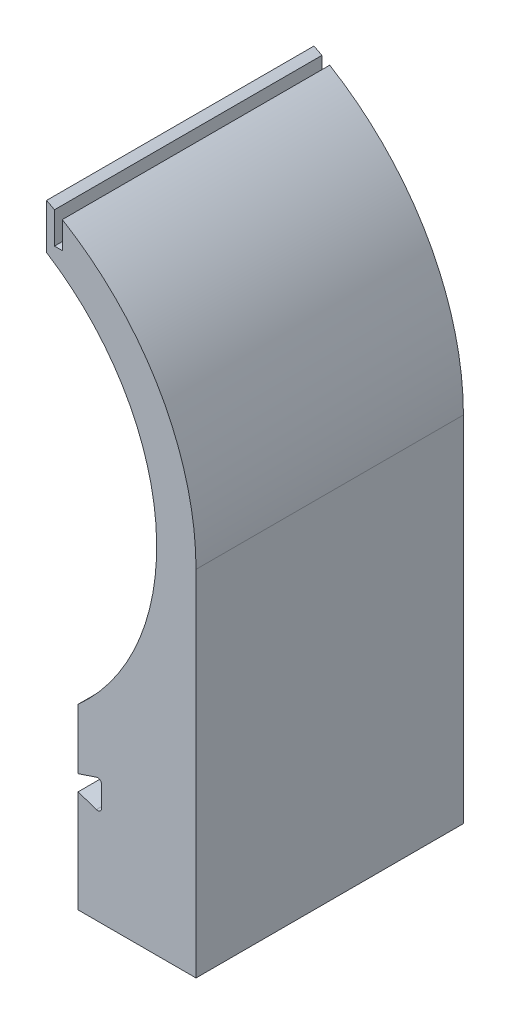
ISO-10303-21;
HEADER;
FILE_DESCRIPTION(('STEP AP214'),'2;1');
FILE_NAME('part.step','',(''),(''),'','','');
FILE_SCHEMA(('AUTOMOTIVE_DESIGN { 1 0 10303 214 1 1 1 1 }'));
ENDSEC;
DATA;
#1=APPLICATION_CONTEXT('core data for automotive mechanical design processes');
#2=APPLICATION_PROTOCOL_DEFINITION('international standard','automotive_design',2000,#1);
#3=PRODUCT_CONTEXT('',#1,'mechanical');
#4=PRODUCT('Part','Part','',(#3));
#5=PRODUCT_RELATED_PRODUCT_CATEGORY('part','',(#4));
#6=PRODUCT_DEFINITION_FORMATION('','',#4);
#7=PRODUCT_DEFINITION_CONTEXT('part definition',#1,'design');
#8=PRODUCT_DEFINITION('design','',#6,#7);
#9=PRODUCT_DEFINITION_SHAPE('','',#8);
#10=(LENGTH_UNIT() NAMED_UNIT(*) SI_UNIT(.MILLI.,.METRE.));
#11=(NAMED_UNIT(*) PLANE_ANGLE_UNIT() SI_UNIT($,.RADIAN.));
#12=(NAMED_UNIT(*) SI_UNIT($,.STERADIAN.) SOLID_ANGLE_UNIT());
#13=UNCERTAINTY_MEASURE_WITH_UNIT(LENGTH_MEASURE(1.E-05),#10,'distance_accuracy_value','');
#14=(GEOMETRIC_REPRESENTATION_CONTEXT(3) GLOBAL_UNCERTAINTY_ASSIGNED_CONTEXT((#13)) GLOBAL_UNIT_ASSIGNED_CONTEXT((#10,
#11,#12)) REPRESENTATION_CONTEXT('',''));
#15=CARTESIAN_POINT('',(0.,0.,0.));
#16=DIRECTION('',(0.,0.,1.));
#17=DIRECTION('',(1.,0.,0.));
#18=AXIS2_PLACEMENT_3D('',#15,#16,#17);
#19=CARTESIAN_POINT('',(0.,0.,170.));
#20=DIRECTION('',(0.,0.,-1.));
#21=DIRECTION('',(-1.,0.,0.));
#22=AXIS2_PLACEMENT_3D('',#19,#20,#21);
#23=CYLINDRICAL_SURFACE('',#22,175.);
#24=CARTESIAN_POINT('',(0.,0.,0.));
#25=DIRECTION('',(0.,0.,1.));
#26=DIRECTION('',(1.,0.,0.));
#27=AXIS2_PLACEMENT_3D('',#24,#25,#26);
#28=CIRCLE('',#27,175.);
#29=CARTESIAN_POINT('',(85.,152.970585407784,0.));
#30=VERTEX_POINT('',#29);
#31=CARTESIAN_POINT('',(80.,155.643824162734,0.));
#32=VERTEX_POINT('',#31);
#33=EDGE_CURVE('E188',#30,#32,#28,.T.);
#34=ORIENTED_EDGE('',*,*,#33,.T.);
#35=DIRECTION('',(0.,0.,-1.));
#36=VECTOR('',#35,1.);
#37=CARTESIAN_POINT('',(80.,155.643824162734,170.));
#38=LINE('',#37,#36);
#39=CARTESIAN_POINT('',(80.,155.643824162734,170.));
#40=VERTEX_POINT('',#39);
#41=EDGE_CURVE('E11',#40,#32,#38,.T.);
#42=ORIENTED_EDGE('',*,*,#41,.F.);
#43=CARTESIAN_POINT('',(0.,0.,170.));
#44=DIRECTION('',(0.,0.,1.));
#45=DIRECTION('',(1.,0.,0.));
#46=AXIS2_PLACEMENT_3D('',#43,#44,#45);
#47=CIRCLE('',#46,175.);
#48=CARTESIAN_POINT('',(85.,152.970585407784,170.));
#49=VERTEX_POINT('',#48);
#50=EDGE_CURVE('E234',#49,#40,#47,.T.);
#51=ORIENTED_EDGE('',*,*,#50,.F.);
#52=DIRECTION('',(0.,0.,-1.));
#53=VECTOR('',#52,1.);
#54=CARTESIAN_POINT('',(85.,152.970585407784,170.));
#55=LINE('',#54,#53);
#56=EDGE_CURVE('E184',#49,#30,#55,.T.);
#57=ORIENTED_EDGE('',*,*,#56,.T.);
#58=EDGE_LOOP('',(#34,#42,#51,#57));
#59=FACE_BOUND('',#58,.T.);
#60=ADVANCED_FACE('F39',(#59),#23,.T.);
#61=CARTESIAN_POINT('',(80.,155.643824162734,170.));
#62=DIRECTION('',(1.,0.,0.));
#63=DIRECTION('',(0.,1.,0.));
#64=AXIS2_PLACEMENT_3D('',#61,#62,#63);
#65=PLANE('',#64);
#66=DIRECTION('',(0.,-1.,0.));
#67=VECTOR('',#66,1.);
#68=CARTESIAN_POINT('',(80.,155.643824162734,0.));
#69=LINE('',#68,#67);
#70=CARTESIAN_POINT('',(80.,126.885775404495,0.));
#71=VERTEX_POINT('',#70);
#72=EDGE_CURVE('E192',#32,#71,#69,.T.);
#73=ORIENTED_EDGE('',*,*,#72,.T.);
#74=DIRECTION('',(0.,0.,-1.));
#75=VECTOR('',#74,1.);
#76=CARTESIAN_POINT('',(80.,126.885775404495,170.));
#77=LINE('',#76,#75);
#78=CARTESIAN_POINT('',(80.,126.885775404495,170.));
#79=VERTEX_POINT('',#78);
#80=EDGE_CURVE('E48',#79,#71,#77,.T.);
#81=ORIENTED_EDGE('',*,*,#80,.F.);
#82=DIRECTION('',(0.,-1.,0.));
#83=VECTOR('',#82,1.);
#84=CARTESIAN_POINT('',(80.,155.643824162734,170.));
#85=LINE('',#84,#83);
#86=EDGE_CURVE('E123',#40,#79,#85,.T.);
#87=ORIENTED_EDGE('',*,*,#86,.F.);
#88=ORIENTED_EDGE('',*,*,#41,.T.);
#89=EDGE_LOOP('',(#73,#81,#87,#88));
#90=FACE_BOUND('',#89,.T.);
#91=ADVANCED_FACE('F356',(#90),#65,.F.);
#92=CARTESIAN_POINT('',(0.,0.,170.));
#93=DIRECTION('',(0.,0.,-1.));
#94=DIRECTION('',(-1.,0.,0.));
#95=AXIS2_PLACEMENT_3D('',#92,#93,#94);
#96=CYLINDRICAL_SURFACE('',#95,150.);
#97=CARTESIAN_POINT('',(0.,0.,0.));
#98=DIRECTION('',(0.,0.,-1.));
#99=DIRECTION('',(-1.,0.,0.));
#100=AXIS2_PLACEMENT_3D('',#97,#98,#99);
#101=CIRCLE('',#100,150.);
#102=CARTESIAN_POINT('',(100.,-111.803398874989,0.));
#103=VERTEX_POINT('',#102);
#104=EDGE_CURVE('E195',#71,#103,#101,.T.);
#105=ORIENTED_EDGE('',*,*,#104,.T.);
#106=DIRECTION('',(0.,0.,-1.));
#107=VECTOR('',#106,1.);
#108=CARTESIAN_POINT('',(100.,-111.803398874989,170.));
#109=LINE('',#108,#107);
#110=CARTESIAN_POINT('',(100.,-111.803398874989,170.));
#111=VERTEX_POINT('',#110);
#112=EDGE_CURVE('E277',#111,#103,#109,.T.);
#113=ORIENTED_EDGE('',*,*,#112,.F.);
#114=CARTESIAN_POINT('',(0.,0.,170.));
#115=DIRECTION('',(0.,0.,-1.));
#116=DIRECTION('',(-1.,0.,0.));
#117=AXIS2_PLACEMENT_3D('',#114,#115,#116);
#118=CIRCLE('',#117,150.);
#119=EDGE_CURVE('E287',#79,#111,#118,.T.);
#120=ORIENTED_EDGE('',*,*,#119,.F.);
#121=ORIENTED_EDGE('',*,*,#80,.T.);
#122=EDGE_LOOP('',(#105,#113,#120,#121));
#123=FACE_BOUND('',#122,.T.);
#124=ADVANCED_FACE('F285',(#123),#96,.F.);
#125=CARTESIAN_POINT('',(100.,-111.803398874989,170.));
#126=DIRECTION('',(1.,0.,0.));
#127=DIRECTION('',(0.,0.,-1.));
#128=AXIS2_PLACEMENT_3D('',#125,#126,#127);
#129=PLANE('',#128);
#130=DIRECTION('',(0.,-1.,0.));
#131=VECTOR('',#130,1.);
#132=CARTESIAN_POINT('',(100.,-111.803398874989,0.));
#133=LINE('',#132,#131);
#134=CARTESIAN_POINT('',(100.,-150.,0.));
#135=VERTEX_POINT('',#134);
#136=EDGE_CURVE('E198',#103,#135,#133,.T.);
#137=ORIENTED_EDGE('',*,*,#136,.T.);
#138=DIRECTION('',(0.,0.,-1.));
#139=VECTOR('',#138,1.);
#140=CARTESIAN_POINT('',(100.,-150.,170.));
#141=LINE('',#140,#139);
#142=CARTESIAN_POINT('',(100.,-150.,170.));
#143=VERTEX_POINT('',#142);
#144=EDGE_CURVE('E273',#143,#135,#141,.T.);
#145=ORIENTED_EDGE('',*,*,#144,.F.);
#146=DIRECTION('',(0.,-1.,0.));
#147=VECTOR('',#146,1.);
#148=CARTESIAN_POINT('',(100.,-111.803398874989,170.));
#149=LINE('',#148,#147);
#150=EDGE_CURVE('E306',#111,#143,#149,.T.);
#151=ORIENTED_EDGE('',*,*,#150,.F.);
#152=ORIENTED_EDGE('',*,*,#112,.T.);
#153=EDGE_LOOP('',(#137,#145,#151,#152));
#154=FACE_BOUND('',#153,.T.);
#155=ADVANCED_FACE('F296',(#154),#129,.F.);
#156=CARTESIAN_POINT('',(100.,-150.,170.));
#157=DIRECTION('',(-0.316227766016838,0.948683298050514,0.));
#158=DIRECTION('',(-0.948683298050514,-0.316227766016838,0.));
#159=AXIS2_PLACEMENT_3D('',#156,#157,#158);
#160=PLANE('',#159);
#161=DIRECTION('',(0.948683298050514,0.316227766016838,0.));
#162=VECTOR('',#161,1.);
#163=CARTESIAN_POINT('',(100.,-150.,0.));
#164=LINE('',#163,#162);
#165=CARTESIAN_POINT('',(111.709430584958,-146.096856471681,0.));
#166=VERTEX_POINT('',#165);
#167=EDGE_CURVE('E201',#135,#166,#164,.T.);
#168=ORIENTED_EDGE('',*,*,#167,.T.);
#169=DIRECTION('',(0.,0.,-1.));
#170=VECTOR('',#169,1.);
#171=CARTESIAN_POINT('',(111.709430584958,-146.096856471681,170.));
#172=LINE('',#171,#170);
#173=CARTESIAN_POINT('',(111.709430584958,-146.096856471681,170.));
#174=VERTEX_POINT('',#173);
#175=EDGE_CURVE('E269',#174,#166,#172,.T.);
#176=ORIENTED_EDGE('',*,*,#175,.F.);
#177=DIRECTION('',(0.948683298050514,0.316227766016838,0.));
#178=VECTOR('',#177,1.);
#179=CARTESIAN_POINT('',(100.,-150.,170.));
#180=LINE('',#179,#178);
#181=EDGE_CURVE('E302',#143,#174,#180,.T.);
#182=ORIENTED_EDGE('',*,*,#181,.F.);
#183=ORIENTED_EDGE('',*,*,#144,.T.);
#184=EDGE_LOOP('',(#168,#176,#182,#183));
#185=FACE_BOUND('',#184,.T.);
#186=ADVANCED_FACE('F300',(#185),#160,.F.);
#187=CARTESIAN_POINT('',(112.5,-148.468564716807,170.));
#188=DIRECTION('',(0.,0.,-1.));
#189=DIRECTION('',(-1.,0.,0.));
#190=AXIS2_PLACEMENT_3D('',#187,#188,#189);
#191=CYLINDRICAL_SURFACE('',#190,2.5);
#192=CARTESIAN_POINT('',(112.5,-148.468564716807,0.));
#193=DIRECTION('',(0.,0.,-1.));
#194=DIRECTION('',(1.,0.,0.));
#195=AXIS2_PLACEMENT_3D('',#192,#193,#194);
#196=CIRCLE('',#195,2.5);
#197=CARTESIAN_POINT('',(115.,-148.468564716807,0.));
#198=VERTEX_POINT('',#197);
#199=EDGE_CURVE('E204',#166,#198,#196,.T.);
#200=ORIENTED_EDGE('',*,*,#199,.T.);
#201=DIRECTION('',(0.,0.,-1.));
#202=VECTOR('',#201,1.);
#203=CARTESIAN_POINT('',(115.,-148.468564716807,170.));
#204=LINE('',#203,#202);
#205=CARTESIAN_POINT('',(115.,-148.468564716807,170.));
#206=VERTEX_POINT('',#205);
#207=EDGE_CURVE('E265',#206,#198,#204,.T.);
#208=ORIENTED_EDGE('',*,*,#207,.F.);
#209=CARTESIAN_POINT('',(112.5,-148.468564716807,170.));
#210=DIRECTION('',(0.,0.,-1.));
#211=DIRECTION('',(1.,0.,0.));
#212=AXIS2_PLACEMENT_3D('',#209,#210,#211);
#213=CIRCLE('',#212,2.5);
#214=EDGE_CURVE('E305',#174,#206,#213,.T.);
#215=ORIENTED_EDGE('',*,*,#214,.F.);
#216=ORIENTED_EDGE('',*,*,#175,.T.);
#217=EDGE_LOOP('',(#200,#208,#215,#216));
#218=FACE_BOUND('',#217,.T.);
#219=ADVANCED_FACE('F369',(#218),#191,.F.);
#220=CARTESIAN_POINT('',(115.,-148.468564716807,170.));
#221=DIRECTION('',(1.,0.,0.));
#222=DIRECTION('',(0.,1.,0.));
#223=AXIS2_PLACEMENT_3D('',#220,#221,#222);
#224=PLANE('',#223);
#225=DIRECTION('',(0.,-1.,0.));
#226=VECTOR('',#225,1.);
#227=CARTESIAN_POINT('',(115.,-148.468564716807,0.));
#228=LINE('',#227,#226);
#229=CARTESIAN_POINT('',(115.,-161.531435283193,0.));
#230=VERTEX_POINT('',#229);
#231=EDGE_CURVE('E207',#198,#230,#228,.T.);
#232=ORIENTED_EDGE('',*,*,#231,.T.);
#233=DIRECTION('',(0.,0.,-1.));
#234=VECTOR('',#233,1.);
#235=CARTESIAN_POINT('',(115.,-161.531435283193,170.));
#236=LINE('',#235,#234);
#237=CARTESIAN_POINT('',(115.,-161.531435283193,170.));
#238=VERTEX_POINT('',#237);
#239=EDGE_CURVE('E261',#238,#230,#236,.T.);
#240=ORIENTED_EDGE('',*,*,#239,.F.);
#241=DIRECTION('',(0.,-1.,0.));
#242=VECTOR('',#241,1.);
#243=CARTESIAN_POINT('',(115.,-148.468564716807,170.));
#244=LINE('',#243,#242);
#245=EDGE_CURVE('E310',#206,#238,#244,.T.);
#246=ORIENTED_EDGE('',*,*,#245,.F.);
#247=ORIENTED_EDGE('',*,*,#207,.T.);
#248=EDGE_LOOP('',(#232,#240,#246,#247));
#249=FACE_BOUND('',#248,.T.);
#250=ADVANCED_FACE('F372',(#249),#224,.F.);
#251=CARTESIAN_POINT('',(112.5,-161.531435283193,170.));
#252=DIRECTION('',(0.,0.,-1.));
#253=DIRECTION('',(-1.,0.,0.));
#254=AXIS2_PLACEMENT_3D('',#251,#252,#253);
#255=CYLINDRICAL_SURFACE('',#254,2.49999999999999);
#256=CARTESIAN_POINT('',(112.5,-161.531435283193,0.));
#257=DIRECTION('',(0.,0.,-1.));
#258=DIRECTION('',(1.,0.,0.));
#259=AXIS2_PLACEMENT_3D('',#256,#257,#258);
#260=CIRCLE('',#259,2.49999999999999);
#261=CARTESIAN_POINT('',(111.709430584958,-163.903143528319,0.));
#262=VERTEX_POINT('',#261);
#263=EDGE_CURVE('E210',#230,#262,#260,.T.);
#264=ORIENTED_EDGE('',*,*,#263,.T.);
#265=DIRECTION('',(0.,0.,-1.));
#266=VECTOR('',#265,1.);
#267=CARTESIAN_POINT('',(111.709430584958,-163.903143528319,170.));
#268=LINE('',#267,#266);
#269=CARTESIAN_POINT('',(111.709430584958,-163.903143528319,170.));
#270=VERTEX_POINT('',#269);
#271=EDGE_CURVE('E257',#270,#262,#268,.T.);
#272=ORIENTED_EDGE('',*,*,#271,.F.);
#273=CARTESIAN_POINT('',(112.5,-161.531435283193,170.));
#274=DIRECTION('',(0.,0.,-1.));
#275=DIRECTION('',(1.,0.,0.));
#276=AXIS2_PLACEMENT_3D('',#273,#274,#275);
#277=CIRCLE('',#276,2.49999999999999);
#278=EDGE_CURVE('E317',#238,#270,#277,.T.);
#279=ORIENTED_EDGE('',*,*,#278,.F.);
#280=ORIENTED_EDGE('',*,*,#239,.T.);
#281=EDGE_LOOP('',(#264,#272,#279,#280));
#282=FACE_BOUND('',#281,.T.);
#283=ADVANCED_FACE('F376',(#282),#255,.F.);
#284=CARTESIAN_POINT('',(111.709430584958,-163.903143528319,170.));
#285=DIRECTION('',(-0.31622776601684,-0.948683298050513,0.));
#286=DIRECTION('',(0.948683298050513,-0.31622776601684,0.));
#287=AXIS2_PLACEMENT_3D('',#284,#285,#286);
#288=PLANE('',#287);
#289=DIRECTION('',(-0.948683298050513,0.31622776601684,0.));
#290=VECTOR('',#289,1.);
#291=CARTESIAN_POINT('',(111.709430584958,-163.903143528319,0.));
#292=LINE('',#291,#290);
#293=CARTESIAN_POINT('',(100.,-160.,0.));
#294=VERTEX_POINT('',#293);
#295=EDGE_CURVE('E213',#262,#294,#292,.T.);
#296=ORIENTED_EDGE('',*,*,#295,.T.);
#297=DIRECTION('',(0.,0.,-1.));
#298=VECTOR('',#297,1.);
#299=CARTESIAN_POINT('',(100.,-160.,170.));
#300=LINE('',#299,#298);
#301=CARTESIAN_POINT('',(100.,-160.,170.));
#302=VERTEX_POINT('',#301);
#303=EDGE_CURVE('E253',#302,#294,#300,.T.);
#304=ORIENTED_EDGE('',*,*,#303,.F.);
#305=DIRECTION('',(-0.948683298050513,0.31622776601684,0.));
#306=VECTOR('',#305,1.);
#307=CARTESIAN_POINT('',(111.709430584958,-163.903143528319,170.));
#308=LINE('',#307,#306);
#309=EDGE_CURVE('E320',#270,#302,#308,.T.);
#310=ORIENTED_EDGE('',*,*,#309,.F.);
#311=ORIENTED_EDGE('',*,*,#271,.T.);
#312=EDGE_LOOP('',(#296,#304,#310,#311));
#313=FACE_BOUND('',#312,.T.);
#314=ADVANCED_FACE('F380',(#313),#288,.F.);
#315=CARTESIAN_POINT('',(100.,-160.,170.));
#316=DIRECTION('',(1.,0.,0.));
#317=DIRECTION('',(0.,1.,0.));
#318=AXIS2_PLACEMENT_3D('',#315,#316,#317);
#319=PLANE('',#318);
#320=DIRECTION('',(0.,-1.,0.));
#321=VECTOR('',#320,1.);
#322=CARTESIAN_POINT('',(100.,-160.,0.));
#323=LINE('',#322,#321);
#324=CARTESIAN_POINT('',(100.,-225.,0.));
#325=VERTEX_POINT('',#324);
#326=EDGE_CURVE('E216',#294,#325,#323,.T.);
#327=ORIENTED_EDGE('',*,*,#326,.T.);
#328=DIRECTION('',(0.,0.,-1.));
#329=VECTOR('',#328,1.);
#330=CARTESIAN_POINT('',(100.,-225.,170.));
#331=LINE('',#330,#329);
#332=CARTESIAN_POINT('',(100.,-225.,170.));
#333=VERTEX_POINT('',#332);
#334=EDGE_CURVE('E249',#333,#325,#331,.T.);
#335=ORIENTED_EDGE('',*,*,#334,.F.);
#336=DIRECTION('',(0.,-1.,0.));
#337=VECTOR('',#336,1.);
#338=CARTESIAN_POINT('',(100.,-160.,170.));
#339=LINE('',#338,#337);
#340=EDGE_CURVE('E323',#302,#333,#339,.T.);
#341=ORIENTED_EDGE('',*,*,#340,.F.);
#342=ORIENTED_EDGE('',*,*,#303,.T.);
#343=EDGE_LOOP('',(#327,#335,#341,#342));
#344=FACE_BOUND('',#343,.T.);
#345=ADVANCED_FACE('F384',(#344),#319,.F.);
#346=CARTESIAN_POINT('',(175.,-225.,170.));
#347=DIRECTION('',(0.,1.,0.));
#348=DIRECTION('',(0.,0.,1.));
#349=AXIS2_PLACEMENT_3D('',#346,#347,#348);
#350=PLANE('',#349);
#351=DIRECTION('',(1.,0.,0.));
#352=VECTOR('',#351,1.);
#353=CARTESIAN_POINT('',(175.,-225.,0.));
#354=LINE('',#353,#352);
#355=CARTESIAN_POINT('',(175.,-225.,0.));
#356=VERTEX_POINT('',#355);
#357=EDGE_CURVE('E219',#325,#356,#354,.T.);
#358=ORIENTED_EDGE('',*,*,#357,.T.);
#359=DIRECTION('',(0.,0.,-1.));
#360=VECTOR('',#359,1.);
#361=CARTESIAN_POINT('',(175.,-225.,170.));
#362=LINE('',#361,#360);
#363=CARTESIAN_POINT('',(175.,-225.,170.));
#364=VERTEX_POINT('',#363);
#365=EDGE_CURVE('E245',#364,#356,#362,.T.);
#366=ORIENTED_EDGE('',*,*,#365,.F.);
#367=DIRECTION('',(1.,0.,0.));
#368=VECTOR('',#367,1.);
#369=CARTESIAN_POINT('',(175.,-225.,170.));
#370=LINE('',#369,#368);
#371=EDGE_CURVE('E326',#333,#364,#370,.T.);
#372=ORIENTED_EDGE('',*,*,#371,.F.);
#373=ORIENTED_EDGE('',*,*,#334,.T.);
#374=EDGE_LOOP('',(#358,#366,#372,#373));
#375=FACE_BOUND('',#374,.T.);
#376=ADVANCED_FACE('F388',(#375),#350,.F.);
#377=CARTESIAN_POINT('',(175.,0.,170.));
#378=DIRECTION('',(-1.,0.,0.));
#379=DIRECTION('',(0.,-1.,0.));
#380=AXIS2_PLACEMENT_3D('',#377,#378,#379);
#381=PLANE('',#380);
#382=DIRECTION('',(0.,1.,0.));
#383=VECTOR('',#382,1.);
#384=CARTESIAN_POINT('',(175.,0.,0.));
#385=LINE('',#384,#383);
#386=CARTESIAN_POINT('',(175.,0.,0.));
#387=VERTEX_POINT('',#386);
#388=EDGE_CURVE('E222',#356,#387,#385,.T.);
#389=ORIENTED_EDGE('',*,*,#388,.T.);
#390=DIRECTION('',(0.,0.,-1.));
#391=VECTOR('',#390,1.);
#392=CARTESIAN_POINT('',(175.,0.,170.));
#393=LINE('',#392,#391);
#394=CARTESIAN_POINT('',(175.,0.,170.));
#395=VERTEX_POINT('',#394);
#396=EDGE_CURVE('E241',#395,#387,#393,.T.);
#397=ORIENTED_EDGE('',*,*,#396,.F.);
#398=DIRECTION('',(0.,1.,0.));
#399=VECTOR('',#398,1.);
#400=CARTESIAN_POINT('',(175.,0.,170.));
#401=LINE('',#400,#399);
#402=EDGE_CURVE('E329',#364,#395,#401,.T.);
#403=ORIENTED_EDGE('',*,*,#402,.F.);
#404=ORIENTED_EDGE('',*,*,#365,.T.);
#405=EDGE_LOOP('',(#389,#397,#403,#404));
#406=FACE_BOUND('',#405,.T.);
#407=ADVANCED_FACE('F337',(#406),#381,.F.);
#408=CARTESIAN_POINT('',(0.,0.,170.));
#409=DIRECTION('',(0.,0.,-1.));
#410=DIRECTION('',(-1.,0.,0.));
#411=AXIS2_PLACEMENT_3D('',#408,#409,#410);
#412=CYLINDRICAL_SURFACE('',#411,175.);
#413=CARTESIAN_POINT('',(0.,0.,0.));
#414=DIRECTION('',(0.,0.,1.));
#415=DIRECTION('',(1.,0.,0.));
#416=AXIS2_PLACEMENT_3D('',#413,#414,#415);
#417=CIRCLE('',#416,175.);
#418=CARTESIAN_POINT('',(90.,150.083310198036,0.));
#419=VERTEX_POINT('',#418);
#420=EDGE_CURVE('E225',#387,#419,#417,.T.);
#421=ORIENTED_EDGE('',*,*,#420,.T.);
#422=DIRECTION('',(0.,0.,-1.));
#423=VECTOR('',#422,1.);
#424=CARTESIAN_POINT('',(90.,150.083310198036,170.));
#425=LINE('',#424,#423);
#426=CARTESIAN_POINT('',(90.,150.083310198036,170.));
#427=VERTEX_POINT('',#426);
#428=EDGE_CURVE('E177',#427,#419,#425,.T.);
#429=ORIENTED_EDGE('',*,*,#428,.F.);
#430=CARTESIAN_POINT('',(0.,0.,170.));
#431=DIRECTION('',(0.,0.,1.));
#432=DIRECTION('',(1.,0.,0.));
#433=AXIS2_PLACEMENT_3D('',#430,#431,#432);
#434=CIRCLE('',#433,175.);
#435=EDGE_CURVE('E166',#395,#427,#434,.T.);
#436=ORIENTED_EDGE('',*,*,#435,.F.);
#437=ORIENTED_EDGE('',*,*,#396,.T.);
#438=EDGE_LOOP('',(#421,#429,#436,#437));
#439=FACE_BOUND('',#438,.T.);
#440=ADVANCED_FACE('F341',(#439),#412,.T.);
#441=CARTESIAN_POINT('',(90.,132.970585407784,170.));
#442=DIRECTION('',(1.,0.,0.));
#443=DIRECTION('',(0.,1.,0.));
#444=AXIS2_PLACEMENT_3D('',#441,#442,#443);
#445=PLANE('',#444);
#446=DIRECTION('',(0.,-1.,0.));
#447=VECTOR('',#446,1.);
#448=CARTESIAN_POINT('',(90.,132.970585407784,0.));
#449=LINE('',#448,#447);
#450=CARTESIAN_POINT('',(90.,132.970585407784,0.));
#451=VERTEX_POINT('',#450);
#452=EDGE_CURVE('E175',#419,#451,#449,.T.);
#453=ORIENTED_EDGE('',*,*,#452,.T.);
#454=DIRECTION('',(0.,0.,-1.));
#455=VECTOR('',#454,1.);
#456=CARTESIAN_POINT('',(90.,132.970585407784,170.));
#457=LINE('',#456,#455);
#458=CARTESIAN_POINT('',(90.,132.970585407784,170.));
#459=VERTEX_POINT('',#458);
#460=EDGE_CURVE('E172',#459,#451,#457,.T.);
#461=ORIENTED_EDGE('',*,*,#460,.F.);
#462=DIRECTION('',(0.,-1.,0.));
#463=VECTOR('',#462,1.);
#464=CARTESIAN_POINT('',(90.,132.970585407784,170.));
#465=LINE('',#464,#463);
#466=EDGE_CURVE('E160',#427,#459,#465,.T.);
#467=ORIENTED_EDGE('',*,*,#466,.F.);
#468=ORIENTED_EDGE('',*,*,#428,.T.);
#469=EDGE_LOOP('',(#453,#461,#467,#468));
#470=FACE_BOUND('',#469,.T.);
#471=ADVANCED_FACE('F173',(#470),#445,.F.);
#472=CARTESIAN_POINT('',(85.,132.970585407784,170.));
#473=DIRECTION('',(0.,-1.,0.));
#474=DIRECTION('',(0.,0.,-1.));
#475=AXIS2_PLACEMENT_3D('',#472,#473,#474);
#476=PLANE('',#475);
#477=DIRECTION('',(-1.,0.,0.));
#478=VECTOR('',#477,1.);
#479=CARTESIAN_POINT('',(85.,132.970585407784,0.));
#480=LINE('',#479,#478);
#481=CARTESIAN_POINT('',(85.,132.970585407784,0.));
#482=VERTEX_POINT('',#481);
#483=EDGE_CURVE('E109',#451,#482,#480,.T.);
#484=ORIENTED_EDGE('',*,*,#483,.T.);
#485=DIRECTION('',(0.,0.,-1.));
#486=VECTOR('',#485,1.);
#487=CARTESIAN_POINT('',(85.,132.970585407784,170.));
#488=LINE('',#487,#486);
#489=CARTESIAN_POINT('',(85.,132.970585407784,170.));
#490=VERTEX_POINT('',#489);
#491=EDGE_CURVE('E178',#490,#482,#488,.T.);
#492=ORIENTED_EDGE('',*,*,#491,.F.);
#493=DIRECTION('',(-1.,0.,0.));
#494=VECTOR('',#493,1.);
#495=CARTESIAN_POINT('',(85.,132.970585407784,170.));
#496=LINE('',#495,#494);
#497=EDGE_CURVE('E164',#459,#490,#496,.T.);
#498=ORIENTED_EDGE('',*,*,#497,.F.);
#499=ORIENTED_EDGE('',*,*,#460,.T.);
#500=EDGE_LOOP('',(#484,#492,#498,#499));
#501=FACE_BOUND('',#500,.T.);
#502=ADVANCED_FACE('F180',(#501),#476,.F.);
#503=CARTESIAN_POINT('',(85.,152.970585407784,170.));
#504=DIRECTION('',(-1.,0.,0.));
#505=DIRECTION('',(0.,0.,1.));
#506=AXIS2_PLACEMENT_3D('',#503,#504,#505);
#507=PLANE('',#506);
#508=DIRECTION('',(0.,1.,0.));
#509=VECTOR('',#508,1.);
#510=CARTESIAN_POINT('',(85.,152.970585407784,0.));
#511=LINE('',#510,#509);
#512=EDGE_CURVE('E115',#482,#30,#511,.T.);
#513=ORIENTED_EDGE('',*,*,#512,.T.);
#514=ORIENTED_EDGE('',*,*,#56,.F.);
#515=DIRECTION('',(0.,1.,0.));
#516=VECTOR('',#515,1.);
#517=CARTESIAN_POINT('',(85.,152.970585407784,170.));
#518=LINE('',#517,#516);
#519=EDGE_CURVE('E56',#490,#49,#518,.T.);
#520=ORIENTED_EDGE('',*,*,#519,.F.);
#521=ORIENTED_EDGE('',*,*,#491,.T.);
#522=EDGE_LOOP('',(#513,#514,#520,#521));
#523=FACE_BOUND('',#522,.T.);
#524=ADVANCED_FACE('F345',(#523),#507,.F.);
#525=CARTESIAN_POINT('',(0.,0.,170.));
#526=DIRECTION('',(0.,0.,1.));
#527=DIRECTION('',(1.,0.,0.));
#528=AXIS2_PLACEMENT_3D('',#525,#526,#527);
#529=PLANE('',#528);
#530=ORIENTED_EDGE('',*,*,#50,.T.);
#531=ORIENTED_EDGE('',*,*,#86,.T.);
#532=ORIENTED_EDGE('',*,*,#119,.T.);
#533=ORIENTED_EDGE('',*,*,#150,.T.);
#534=ORIENTED_EDGE('',*,*,#181,.T.);
#535=ORIENTED_EDGE('',*,*,#214,.T.);
#536=ORIENTED_EDGE('',*,*,#245,.T.);
#537=ORIENTED_EDGE('',*,*,#278,.T.);
#538=ORIENTED_EDGE('',*,*,#309,.T.);
#539=ORIENTED_EDGE('',*,*,#340,.T.);
#540=ORIENTED_EDGE('',*,*,#371,.T.);
#541=ORIENTED_EDGE('',*,*,#402,.T.);
#542=ORIENTED_EDGE('',*,*,#435,.T.);
#543=ORIENTED_EDGE('',*,*,#466,.T.);
#544=ORIENTED_EDGE('',*,*,#497,.T.);
#545=ORIENTED_EDGE('',*,*,#519,.T.);
#546=EDGE_LOOP('',(#530,#531,#532,#533,#534,#535,#536,#537,#538,#539,#540,#541,#542,#543,#544,#545));
#547=FACE_BOUND('',#546,.T.);
#548=ADVANCED_FACE('F162',(#547),#529,.T.);
#549=CARTESIAN_POINT('',(0.,0.,0.));
#550=DIRECTION('',(0.,0.,1.));
#551=DIRECTION('',(1.,0.,0.));
#552=AXIS2_PLACEMENT_3D('',#549,#550,#551);
#553=PLANE('',#552);
#554=ORIENTED_EDGE('',*,*,#33,.F.);
#555=ORIENTED_EDGE('',*,*,#512,.F.);
#556=ORIENTED_EDGE('',*,*,#483,.F.);
#557=ORIENTED_EDGE('',*,*,#452,.F.);
#558=ORIENTED_EDGE('',*,*,#420,.F.);
#559=ORIENTED_EDGE('',*,*,#388,.F.);
#560=ORIENTED_EDGE('',*,*,#357,.F.);
#561=ORIENTED_EDGE('',*,*,#326,.F.);
#562=ORIENTED_EDGE('',*,*,#295,.F.);
#563=ORIENTED_EDGE('',*,*,#263,.F.);
#564=ORIENTED_EDGE('',*,*,#231,.F.);
#565=ORIENTED_EDGE('',*,*,#199,.F.);
#566=ORIENTED_EDGE('',*,*,#167,.F.);
#567=ORIENTED_EDGE('',*,*,#136,.F.);
#568=ORIENTED_EDGE('',*,*,#104,.F.);
#569=ORIENTED_EDGE('',*,*,#72,.F.);
#570=EDGE_LOOP('',(#554,#555,#556,#557,#558,#559,#560,#561,#562,#563,#564,#565,#566,#567,#568,#569));
#571=FACE_BOUND('',#570,.T.);
#572=ADVANCED_FACE('F291',(#571),#553,.F.);
#573=CLOSED_SHELL('',(#60,#91,#124,#155,#186,#219,#250,#283,#314,#345,#376,#407,#440,#471,#502,
#524,#548,#572));
#574=MANIFOLD_SOLID_BREP('B2',#573);
#575=ADVANCED_BREP_SHAPE_REPRESENTATION('',(#18,#574),#14);
#576=SHAPE_DEFINITION_REPRESENTATION(#9,#575);
ENDSEC;
END-ISO-10303-21;
